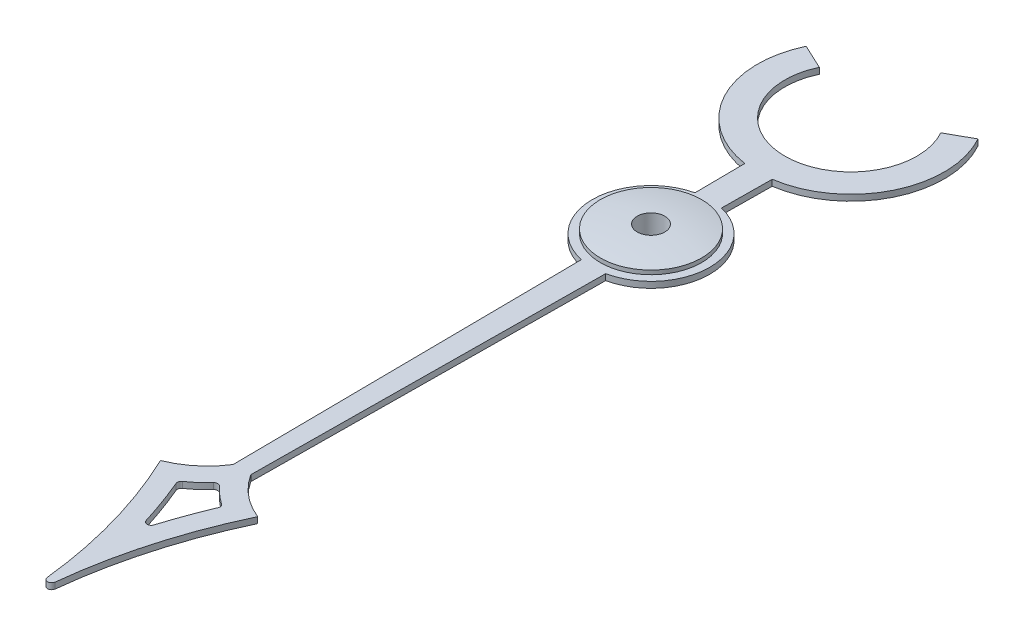
ISO-10303-21;
HEADER;
FILE_DESCRIPTION(('STEP AP214'),'2;1');
FILE_NAME('part.step','',(''),(''),'','','');
FILE_SCHEMA(('AUTOMOTIVE_DESIGN { 1 0 10303 214 1 1 1 1 }'));
ENDSEC;
DATA;
#1=APPLICATION_CONTEXT('core data for automotive mechanical design processes');
#2=APPLICATION_PROTOCOL_DEFINITION('international standard','automotive_design',2000,#1);
#3=PRODUCT_CONTEXT('',#1,'mechanical');
#4=PRODUCT('Part','Part','',(#3));
#5=PRODUCT_RELATED_PRODUCT_CATEGORY('part','',(#4));
#6=PRODUCT_DEFINITION_FORMATION('','',#4);
#7=PRODUCT_DEFINITION_CONTEXT('part definition',#1,'design');
#8=PRODUCT_DEFINITION('design','',#6,#7);
#9=PRODUCT_DEFINITION_SHAPE('','',#8);
#10=(LENGTH_UNIT() NAMED_UNIT(*) SI_UNIT(.MILLI.,.METRE.));
#11=(NAMED_UNIT(*) PLANE_ANGLE_UNIT() SI_UNIT($,.RADIAN.));
#12=(NAMED_UNIT(*) SI_UNIT($,.STERADIAN.) SOLID_ANGLE_UNIT());
#13=UNCERTAINTY_MEASURE_WITH_UNIT(LENGTH_MEASURE(1.E-05),#10,'distance_accuracy_value','');
#14=(GEOMETRIC_REPRESENTATION_CONTEXT(3) GLOBAL_UNCERTAINTY_ASSIGNED_CONTEXT((#13)) GLOBAL_UNIT_ASSIGNED_CONTEXT((#10,
#11,#12)) REPRESENTATION_CONTEXT('',''));
#15=CARTESIAN_POINT('',(0.,0.,0.));
#16=DIRECTION('',(0.,0.,1.));
#17=DIRECTION('',(1.,0.,0.));
#18=AXIS2_PLACEMENT_3D('',#15,#16,#17);
#19=CARTESIAN_POINT('',(12.1679754207257,0.15,16.115943661657));
#20=DIRECTION('',(0.,-1.,0.));
#21=DIRECTION('',(0.,0.,-1.));
#22=AXIS2_PLACEMENT_3D('',#19,#20,#21);
#23=PLANE('',#22);
#24=CARTESIAN_POINT('',(0.,0.15,0.));
#25=DIRECTION('',(0.,-1.,0.));
#26=DIRECTION('',(0.,0.,-1.));
#27=AXIS2_PLACEMENT_3D('',#24,#25,#26);
#28=CIRCLE('',#27,0.75);
#29=CARTESIAN_POINT('',(0.,0.15,-0.75));
#30=VERTEX_POINT('',#29);
#31=EDGE_CURVE('E271',#30,#30,#28,.T.);
#32=ORIENTED_EDGE('',*,*,#31,.F.);
#33=EDGE_LOOP('',(#32));
#34=FACE_BOUND('',#33,.T.);
#35=CARTESIAN_POINT('',(12.1679754207257,0.15,16.115943661657));
#36=DIRECTION('',(0.,1.,0.));
#37=DIRECTION('',(0.,0.,-1.));
#38=AXIS2_PLACEMENT_3D('',#35,#36,#37);
#39=CIRCLE('',#38,12.1392346232099);
#40=CARTESIAN_POINT('',(1.2,0.15,10.9135853110918));
#41=VERTEX_POINT('',#40);
#42=CARTESIAN_POINT('',(0.0982775993540998,0.15,14.8184800829326));
#43=VERTEX_POINT('',#42);
#44=EDGE_CURVE('E277',#41,#43,#39,.T.);
#45=ORIENTED_EDGE('',*,*,#44,.T.);
#46=CARTESIAN_POINT('',(0.,0.15,14.8));
#47=DIRECTION('',(0.,-1.,0.));
#48=DIRECTION('',(0.,0.,-1.));
#49=AXIS2_PLACEMENT_3D('',#46,#47,#48);
#50=CIRCLE('',#49,0.0999999999999994);
#51=CARTESIAN_POINT('',(-0.0982775993541001,0.15,14.8184800829326));
#52=VERTEX_POINT('',#51);
#53=EDGE_CURVE('E280',#43,#52,#50,.T.);
#54=ORIENTED_EDGE('',*,*,#53,.T.);
#55=CARTESIAN_POINT('',(-12.1679754207257,0.15,16.115943661657));
#56=DIRECTION('',(0.,1.,0.));
#57=DIRECTION('',(0.,0.,1.));
#58=AXIS2_PLACEMENT_3D('',#55,#56,#57);
#59=CIRCLE('',#58,12.1392346232099);
#60=CARTESIAN_POINT('',(-1.2,0.15,10.9135853110918));
#61=VERTEX_POINT('',#60);
#62=EDGE_CURVE('E283',#52,#61,#59,.T.);
#63=ORIENTED_EDGE('',*,*,#62,.T.);
#64=CARTESIAN_POINT('',(-1.97070913820673,0.15,8.98030368119698));
#65=DIRECTION('',(0.,1.,0.));
#66=DIRECTION('',(0.,0.,1.));
#67=AXIS2_PLACEMENT_3D('',#64,#65,#66);
#68=CIRCLE('',#67,2.08124252219777);
#69=CARTESIAN_POINT('',(-0.217926100813383,0.15,10.1024988781348));
#70=VERTEX_POINT('',#69);
#71=EDGE_CURVE('E285',#61,#70,#68,.T.);
#72=ORIENTED_EDGE('',*,*,#71,.T.);
#73=DIRECTION('',(-0.00945087932293805,0.,-0.999955339442729));
#74=VECTOR('',#73,1.);
#75=CARTESIAN_POINT('',(-0.217926100813383,0.15,10.1024988781348));
#76=LINE('',#75,#74);
#77=CARTESIAN_POINT('',(-0.3,0.15,1.41862609591111));
#78=VERTEX_POINT('',#77);
#79=EDGE_CURVE('E287',#70,#78,#76,.T.);
#80=ORIENTED_EDGE('',*,*,#79,.T.);
#81=CARTESIAN_POINT('',(0.,0.15,0.));
#82=DIRECTION('',(0.,-1.,0.));
#83=DIRECTION('',(0.,0.,-1.));
#84=AXIS2_PLACEMENT_3D('',#81,#82,#83);
#85=CIRCLE('',#84,1.45);
#86=CARTESIAN_POINT('',(-0.326759739049901,0.15,-1.41270240069735));
#87=VERTEX_POINT('',#86);
#88=EDGE_CURVE('E289',#78,#87,#85,.T.);
#89=ORIENTED_EDGE('',*,*,#88,.T.);
#90=DIRECTION('',(-0.00945087932293789,0.,-0.999955339442729));
#91=VECTOR('',#90,1.);
#92=CARTESIAN_POINT('',(-0.326759739049901,0.15,-1.41270240069735));
#93=LINE('',#92,#91);
#94=CARTESIAN_POINT('',(-0.338500561424638,0.15,-2.65494638899724));
#95=VERTEX_POINT('',#94);
#96=EDGE_CURVE('E291',#87,#95,#93,.T.);
#97=ORIENTED_EDGE('',*,*,#96,.T.);
#98=CARTESIAN_POINT('',(0.,0.15,-4.93742096375434));
#99=DIRECTION('',(0.,-1.,0.));
#100=DIRECTION('',(0.,0.,-1.));
#101=AXIS2_PLACEMENT_3D('',#98,#99,#100);
#102=CIRCLE('',#101,2.30743858303907);
#103=CARTESIAN_POINT('',(-2.08818750921553,0.15,-5.91912649030169));
#104=VERTEX_POINT('',#103);
#105=EDGE_CURVE('E293',#95,#104,#102,.T.);
#106=ORIENTED_EDGE('',*,*,#105,.T.);
#107=DIRECTION('',(0.905115867383996,0.,0.425164987516278));
#108=VECTOR('',#107,1.);
#109=CARTESIAN_POINT('',(-2.08818750921553,0.15,-5.91912649030169));
#110=LINE('',#109,#108);
#111=CARTESIAN_POINT('',(-1.4767232716382,0.15,-5.63190007619892));
#112=VERTEX_POINT('',#111);
#113=EDGE_CURVE('E295',#104,#112,#110,.T.);
#114=ORIENTED_EDGE('',*,*,#113,.T.);
#115=CARTESIAN_POINT('',(0.,0.15,-4.93742096375434));
#116=DIRECTION('',(0.,1.,0.));
#117=DIRECTION('',(0.,0.,-1.));
#118=AXIS2_PLACEMENT_3D('',#115,#116,#117);
#119=CIRCLE('',#118,1.63187403270585);
#120=CARTESIAN_POINT('',(1.4260211736018,0.15,-5.7308164962972));
#121=VERTEX_POINT('',#120);
#122=EDGE_CURVE('E297',#112,#121,#119,.T.);
#123=ORIENTED_EDGE('',*,*,#122,.T.);
#124=DIRECTION('',(0.874064876458558,0.,-0.485809213314738));
#125=VECTOR('',#124,1.);
#126=CARTESIAN_POINT('',(1.4260211736018,0.15,-5.7308164962972));
#127=LINE('',#126,#125);
#128=CARTESIAN_POINT('',(2.01650845779341,0.15,-6.05901200069473));
#129=VERTEX_POINT('',#128);
#130=EDGE_CURVE('E299',#121,#129,#127,.T.);
#131=ORIENTED_EDGE('',*,*,#130,.T.);
#132=CARTESIAN_POINT('',(0.,0.15,-4.93742096375434));
#133=DIRECTION('',(0.,-1.,0.));
#134=DIRECTION('',(0.,0.,-1.));
#135=AXIS2_PLACEMENT_3D('',#132,#133,#134);
#136=CIRCLE('',#135,2.30743858303907);
#137=CARTESIAN_POINT('',(0.338500561424638,0.15,-2.65494638899724));
#138=VERTEX_POINT('',#137);
#139=EDGE_CURVE('E301',#129,#138,#136,.T.);
#140=ORIENTED_EDGE('',*,*,#139,.T.);
#141=DIRECTION('',(-0.00945087932293784,0.,0.999955339442729));
#142=VECTOR('',#141,1.);
#143=CARTESIAN_POINT('',(0.326759739049901,0.15,-1.41270240069735));
#144=LINE('',#143,#142);
#145=CARTESIAN_POINT('',(0.326759739049901,0.15,-1.41270240069735));
#146=VERTEX_POINT('',#145);
#147=EDGE_CURVE('E303',#138,#146,#144,.T.);
#148=ORIENTED_EDGE('',*,*,#147,.T.);
#149=CARTESIAN_POINT('',(0.,0.15,0.));
#150=DIRECTION('',(0.,-1.,0.));
#151=DIRECTION('',(0.,0.,-1.));
#152=AXIS2_PLACEMENT_3D('',#149,#150,#151);
#153=CIRCLE('',#152,1.45);
#154=CARTESIAN_POINT('',(0.300000000000001,0.15,1.41862609591111));
#155=VERTEX_POINT('',#154);
#156=EDGE_CURVE('E305',#146,#155,#153,.T.);
#157=ORIENTED_EDGE('',*,*,#156,.T.);
#158=DIRECTION('',(-0.00945087932293803,0.,0.999955339442729));
#159=VECTOR('',#158,1.);
#160=CARTESIAN_POINT('',(0.217926100813383,0.15,10.1024988781348));
#161=LINE('',#160,#159);
#162=CARTESIAN_POINT('',(0.217926100813383,0.15,10.1024988781348));
#163=VERTEX_POINT('',#162);
#164=EDGE_CURVE('E307',#155,#163,#161,.T.);
#165=ORIENTED_EDGE('',*,*,#164,.T.);
#166=CARTESIAN_POINT('',(1.97070913820673,0.15,8.98030368119698));
#167=DIRECTION('',(0.,1.,0.));
#168=DIRECTION('',(0.,0.,-1.));
#169=AXIS2_PLACEMENT_3D('',#166,#167,#168);
#170=CIRCLE('',#169,2.08124252219777);
#171=EDGE_CURVE('E309',#163,#41,#170,.T.);
#172=ORIENTED_EDGE('',*,*,#171,.T.);
#173=EDGE_LOOP('',(#45,#54,#63,#72,#80,#89,#97,#106,#114,#123,#131,#140,#148,#157,#165,#172));
#174=FACE_BOUND('',#173,.T.);
#175=CARTESIAN_POINT('',(-12.1679754207257,0.15,16.115943661657));
#176=DIRECTION('',(0.,1.,0.));
#177=DIRECTION('',(0.,0.,1.));
#178=AXIS2_PLACEMENT_3D('',#175,#176,#177);
#179=CIRCLE('',#178,12.6392346232099);
#180=CARTESIAN_POINT('',(-0.0955157494199558,0.15,12.373488672583));
#181=VERTEX_POINT('',#180);
#182=CARTESIAN_POINT('',(-0.519143249821563,0.15,11.2113579590051));
#183=VERTEX_POINT('',#182);
#184=EDGE_CURVE('E214',#181,#183,#179,.T.);
#185=ORIENTED_EDGE('',*,*,#184,.F.);
#186=CARTESIAN_POINT('',(0.,0.15,12.3438788496733));
#187=DIRECTION('',(0.,-1.,0.));
#188=DIRECTION('',(0.,0.,-1.));
#189=AXIS2_PLACEMENT_3D('',#186,#187,#188);
#190=CIRCLE('',#189,0.0999999999999999);
#191=CARTESIAN_POINT('',(0.0955157494199575,0.15,12.373488672583));
#192=VERTEX_POINT('',#191);
#193=EDGE_CURVE('E206',#192,#181,#190,.T.);
#194=ORIENTED_EDGE('',*,*,#193,.F.);
#195=CARTESIAN_POINT('',(12.1679754207257,0.15,16.115943661657));
#196=DIRECTION('',(0.,1.,0.));
#197=DIRECTION('',(0.,0.,-1.));
#198=AXIS2_PLACEMENT_3D('',#195,#196,#197);
#199=CIRCLE('',#198,12.6392346232099);
#200=CARTESIAN_POINT('',(0.519143249821561,0.15,11.2113579590051));
#201=VERTEX_POINT('',#200);
#202=EDGE_CURVE('E239',#201,#192,#199,.T.);
#203=ORIENTED_EDGE('',*,*,#202,.F.);
#204=CARTESIAN_POINT('',(0.426979186742041,0.15,11.1725535072415));
#205=DIRECTION('',(0.,-1.,0.));
#206=DIRECTION('',(0.,0.,-1.));
#207=AXIS2_PLACEMENT_3D('',#204,#205,#206);
#208=CIRCLE('',#207,0.1);
#209=CARTESIAN_POINT('',(0.484554357159648,0.15,11.0907910479378));
#210=VERTEX_POINT('',#209);
#211=EDGE_CURVE('E237',#210,#201,#208,.T.);
#212=ORIENTED_EDGE('',*,*,#211,.F.);
#213=CARTESIAN_POINT('',(1.97070913820673,0.15,8.98030368119698));
#214=DIRECTION('',(0.,1.,0.));
#215=DIRECTION('',(0.,0.,-1.));
#216=AXIS2_PLACEMENT_3D('',#213,#214,#215);
#217=CIRCLE('',#216,2.58124252219777);
#218=CARTESIAN_POINT('',(0.0734998465036795,0.15,10.7305636224279));
#219=VERTEX_POINT('',#218);
#220=EDGE_CURVE('E235',#219,#210,#217,.T.);
#221=ORIENTED_EDGE('',*,*,#220,.F.);
#222=CARTESIAN_POINT('',(0.,0.15,10.7983704993943));
#223=DIRECTION('',(0.,-1.,0.));
#224=DIRECTION('',(0.,0.,1.));
#225=AXIS2_PLACEMENT_3D('',#222,#223,#224);
#226=CIRCLE('',#225,0.1);
#227=CARTESIAN_POINT('',(-0.0734998465036802,0.15,10.7305636224279));
#228=VERTEX_POINT('',#227);
#229=EDGE_CURVE('E233',#228,#219,#226,.T.);
#230=ORIENTED_EDGE('',*,*,#229,.F.);
#231=CARTESIAN_POINT('',(-1.97070913820673,0.15,8.98030368119698));
#232=DIRECTION('',(0.,1.,0.));
#233=DIRECTION('',(0.,0.,1.));
#234=AXIS2_PLACEMENT_3D('',#231,#232,#233);
#235=CIRCLE('',#234,2.58124252219777);
#236=CARTESIAN_POINT('',(-0.484554357159646,0.15,11.0907910479378));
#237=VERTEX_POINT('',#236);
#238=EDGE_CURVE('E229',#237,#228,#235,.T.);
#239=ORIENTED_EDGE('',*,*,#238,.F.);
#240=CARTESIAN_POINT('',(-0.42697918674204,0.15,11.1725535072415));
#241=DIRECTION('',(0.,-1.,0.));
#242=DIRECTION('',(0.,0.,-1.));
#243=AXIS2_PLACEMENT_3D('',#240,#241,#242);
#244=CIRCLE('',#243,0.1);
#245=EDGE_CURVE('E227',#183,#237,#244,.T.);
#246=ORIENTED_EDGE('',*,*,#245,.F.);
#247=EDGE_LOOP('',(#185,#194,#203,#212,#221,#230,#239,#246));
#248=FACE_BOUND('',#247,.T.);
#249=ADVANCED_FACE('F45',(#34,#174,#248),#23,.T.);
#250=CARTESIAN_POINT('',(12.1679754207257,0.3,16.115943661657));
#251=DIRECTION('',(0.,-1.,0.));
#252=DIRECTION('',(0.,0.,-1.));
#253=AXIS2_PLACEMENT_3D('',#250,#251,#252);
#254=PLANE('',#253);
#255=CARTESIAN_POINT('',(0.,0.3,0.));
#256=DIRECTION('',(0.,-1.,0.));
#257=DIRECTION('',(0.,0.,-1.));
#258=AXIS2_PLACEMENT_3D('',#255,#256,#257);
#259=CIRCLE('',#258,0.75);
#260=CARTESIAN_POINT('',(0.,0.3,-0.75));
#261=VERTEX_POINT('',#260);
#262=EDGE_CURVE('E222',#261,#261,#259,.T.);
#263=ORIENTED_EDGE('',*,*,#262,.T.);
#264=EDGE_LOOP('',(#263));
#265=FACE_BOUND('',#264,.T.);
#266=CARTESIAN_POINT('',(12.1679754207257,0.3,16.115943661657));
#267=DIRECTION('',(0.,1.,0.));
#268=DIRECTION('',(0.,0.,-1.));
#269=AXIS2_PLACEMENT_3D('',#266,#267,#268);
#270=CIRCLE('',#269,12.1392346232099);
#271=CARTESIAN_POINT('',(1.2,0.3,10.9135853110918));
#272=VERTEX_POINT('',#271);
#273=CARTESIAN_POINT('',(0.0982775993540998,0.3,14.8184800829326));
#274=VERTEX_POINT('',#273);
#275=EDGE_CURVE('E274',#272,#274,#270,.T.);
#276=ORIENTED_EDGE('',*,*,#275,.F.);
#277=CARTESIAN_POINT('',(1.97070913820673,0.3,8.98030368119698));
#278=DIRECTION('',(0.,1.,0.));
#279=DIRECTION('',(0.,0.,-1.));
#280=AXIS2_PLACEMENT_3D('',#277,#278,#279);
#281=CIRCLE('',#280,2.08124252219777);
#282=CARTESIAN_POINT('',(0.217926100813383,0.3,10.1024988781348));
#283=VERTEX_POINT('',#282);
#284=EDGE_CURVE('E281',#283,#272,#281,.T.);
#285=ORIENTED_EDGE('',*,*,#284,.F.);
#286=DIRECTION('',(-0.00945087932293803,0.,0.999955339442729));
#287=VECTOR('',#286,1.);
#288=CARTESIAN_POINT('',(0.217926100813383,0.3,10.1024988781348));
#289=LINE('',#288,#287);
#290=CARTESIAN_POINT('',(0.300000000000001,0.3,1.41862609591111));
#291=VERTEX_POINT('',#290);
#292=EDGE_CURVE('E340',#291,#283,#289,.T.);
#293=ORIENTED_EDGE('',*,*,#292,.F.);
#294=CARTESIAN_POINT('',(0.,0.3,0.));
#295=DIRECTION('',(0.,-1.,0.));
#296=DIRECTION('',(0.,0.,-1.));
#297=AXIS2_PLACEMENT_3D('',#294,#295,#296);
#298=CIRCLE('',#297,1.45);
#299=CARTESIAN_POINT('',(0.326759739049901,0.3,-1.41270240069735));
#300=VERTEX_POINT('',#299);
#301=EDGE_CURVE('E338',#300,#291,#298,.T.);
#302=ORIENTED_EDGE('',*,*,#301,.F.);
#303=DIRECTION('',(-0.00945087932293784,0.,0.999955339442729));
#304=VECTOR('',#303,1.);
#305=CARTESIAN_POINT('',(0.326759739049901,0.3,-1.41270240069735));
#306=LINE('',#305,#304);
#307=CARTESIAN_POINT('',(0.338500561424638,0.3,-2.65494638899724));
#308=VERTEX_POINT('',#307);
#309=EDGE_CURVE('E336',#308,#300,#306,.T.);
#310=ORIENTED_EDGE('',*,*,#309,.F.);
#311=CARTESIAN_POINT('',(0.,0.3,-4.93742096375434));
#312=DIRECTION('',(0.,-1.,0.));
#313=DIRECTION('',(0.,0.,-1.));
#314=AXIS2_PLACEMENT_3D('',#311,#312,#313);
#315=CIRCLE('',#314,2.30743858303907);
#316=CARTESIAN_POINT('',(2.01650845779341,0.3,-6.05901200069473));
#317=VERTEX_POINT('',#316);
#318=EDGE_CURVE('E334',#317,#308,#315,.T.);
#319=ORIENTED_EDGE('',*,*,#318,.F.);
#320=DIRECTION('',(0.874064876458558,0.,-0.485809213314738));
#321=VECTOR('',#320,1.);
#322=CARTESIAN_POINT('',(1.4260211736018,0.3,-5.7308164962972));
#323=LINE('',#322,#321);
#324=CARTESIAN_POINT('',(1.4260211736018,0.3,-5.7308164962972));
#325=VERTEX_POINT('',#324);
#326=EDGE_CURVE('E332',#325,#317,#323,.T.);
#327=ORIENTED_EDGE('',*,*,#326,.F.);
#328=CARTESIAN_POINT('',(0.,0.3,-4.93742096375434));
#329=DIRECTION('',(0.,1.,0.));
#330=DIRECTION('',(0.,0.,-1.));
#331=AXIS2_PLACEMENT_3D('',#328,#329,#330);
#332=CIRCLE('',#331,1.63187403270585);
#333=CARTESIAN_POINT('',(-1.4767232716382,0.3,-5.63190007619892));
#334=VERTEX_POINT('',#333);
#335=EDGE_CURVE('E330',#334,#325,#332,.T.);
#336=ORIENTED_EDGE('',*,*,#335,.F.);
#337=DIRECTION('',(0.905115867383996,0.,0.425164987516278));
#338=VECTOR('',#337,1.);
#339=CARTESIAN_POINT('',(-2.08818750921553,0.3,-5.91912649030169));
#340=LINE('',#339,#338);
#341=CARTESIAN_POINT('',(-2.08818750921553,0.3,-5.91912649030169));
#342=VERTEX_POINT('',#341);
#343=EDGE_CURVE('E328',#342,#334,#340,.T.);
#344=ORIENTED_EDGE('',*,*,#343,.F.);
#345=CARTESIAN_POINT('',(0.,0.3,-4.93742096375434));
#346=DIRECTION('',(0.,-1.,0.));
#347=DIRECTION('',(0.,0.,-1.));
#348=AXIS2_PLACEMENT_3D('',#345,#346,#347);
#349=CIRCLE('',#348,2.30743858303907);
#350=CARTESIAN_POINT('',(-0.338500561424638,0.3,-2.65494638899724));
#351=VERTEX_POINT('',#350);
#352=EDGE_CURVE('E326',#351,#342,#349,.T.);
#353=ORIENTED_EDGE('',*,*,#352,.F.);
#354=DIRECTION('',(-0.00945087932293789,0.,-0.999955339442729));
#355=VECTOR('',#354,1.);
#356=CARTESIAN_POINT('',(-0.326759739049901,0.3,-1.41270240069735));
#357=LINE('',#356,#355);
#358=CARTESIAN_POINT('',(-0.326759739049901,0.3,-1.41270240069735));
#359=VERTEX_POINT('',#358);
#360=EDGE_CURVE('E324',#359,#351,#357,.T.);
#361=ORIENTED_EDGE('',*,*,#360,.F.);
#362=CARTESIAN_POINT('',(0.,0.3,0.));
#363=DIRECTION('',(0.,-1.,0.));
#364=DIRECTION('',(0.,0.,-1.));
#365=AXIS2_PLACEMENT_3D('',#362,#363,#364);
#366=CIRCLE('',#365,1.45);
#367=CARTESIAN_POINT('',(-0.3,0.3,1.41862609591111));
#368=VERTEX_POINT('',#367);
#369=EDGE_CURVE('E322',#368,#359,#366,.T.);
#370=ORIENTED_EDGE('',*,*,#369,.F.);
#371=DIRECTION('',(-0.00945087932293805,0.,-0.999955339442729));
#372=VECTOR('',#371,1.);
#373=CARTESIAN_POINT('',(-0.217926100813383,0.3,10.1024988781348));
#374=LINE('',#373,#372);
#375=CARTESIAN_POINT('',(-0.217926100813383,0.3,10.1024988781348));
#376=VERTEX_POINT('',#375);
#377=EDGE_CURVE('E320',#376,#368,#374,.T.);
#378=ORIENTED_EDGE('',*,*,#377,.F.);
#379=CARTESIAN_POINT('',(-1.97070913820673,0.3,8.98030368119698));
#380=DIRECTION('',(0.,1.,0.));
#381=DIRECTION('',(0.,0.,1.));
#382=AXIS2_PLACEMENT_3D('',#379,#380,#381);
#383=CIRCLE('',#382,2.08124252219777);
#384=CARTESIAN_POINT('',(-1.2,0.3,10.9135853110918));
#385=VERTEX_POINT('',#384);
#386=EDGE_CURVE('E318',#385,#376,#383,.T.);
#387=ORIENTED_EDGE('',*,*,#386,.F.);
#388=CARTESIAN_POINT('',(-12.1679754207257,0.3,16.115943661657));
#389=DIRECTION('',(0.,1.,0.));
#390=DIRECTION('',(0.,0.,1.));
#391=AXIS2_PLACEMENT_3D('',#388,#389,#390);
#392=CIRCLE('',#391,12.1392346232099);
#393=CARTESIAN_POINT('',(-0.0982775993541001,0.3,14.8184800829326));
#394=VERTEX_POINT('',#393);
#395=EDGE_CURVE('E316',#394,#385,#392,.T.);
#396=ORIENTED_EDGE('',*,*,#395,.F.);
#397=CARTESIAN_POINT('',(0.,0.3,14.8));
#398=DIRECTION('',(0.,-1.,0.));
#399=DIRECTION('',(0.,0.,-1.));
#400=AXIS2_PLACEMENT_3D('',#397,#398,#399);
#401=CIRCLE('',#400,0.0999999999999994);
#402=EDGE_CURVE('E314',#274,#394,#401,.T.);
#403=ORIENTED_EDGE('',*,*,#402,.F.);
#404=EDGE_LOOP('',(#276,#285,#293,#302,#310,#319,#327,#336,#344,#353,#361,#370,#378,#387,#396,#403));
#405=FACE_BOUND('',#404,.T.);
#406=CARTESIAN_POINT('',(0.,0.3,12.3438788496733));
#407=DIRECTION('',(0.,-1.,0.));
#408=DIRECTION('',(0.,0.,-1.));
#409=AXIS2_PLACEMENT_3D('',#406,#407,#408);
#410=CIRCLE('',#409,0.0999999999999999);
#411=CARTESIAN_POINT('',(0.0955157494199575,0.3,12.373488672583));
#412=VERTEX_POINT('',#411);
#413=CARTESIAN_POINT('',(-0.0955157494199558,0.3,12.373488672583));
#414=VERTEX_POINT('',#413);
#415=EDGE_CURVE('E68',#412,#414,#410,.T.);
#416=ORIENTED_EDGE('',*,*,#415,.T.);
#417=CARTESIAN_POINT('',(-12.1679754207257,0.3,16.115943661657));
#418=DIRECTION('',(0.,1.,0.));
#419=DIRECTION('',(0.,0.,1.));
#420=AXIS2_PLACEMENT_3D('',#417,#418,#419);
#421=CIRCLE('',#420,12.6392346232099);
#422=CARTESIAN_POINT('',(-0.519143249821563,0.3,11.2113579590051));
#423=VERTEX_POINT('',#422);
#424=EDGE_CURVE('E221',#414,#423,#421,.T.);
#425=ORIENTED_EDGE('',*,*,#424,.T.);
#426=CARTESIAN_POINT('',(-0.42697918674204,0.3,11.1725535072415));
#427=DIRECTION('',(0.,-1.,0.));
#428=DIRECTION('',(0.,0.,-1.));
#429=AXIS2_PLACEMENT_3D('',#426,#427,#428);
#430=CIRCLE('',#429,0.1);
#431=CARTESIAN_POINT('',(-0.484554357159646,0.3,11.0907910479378));
#432=VERTEX_POINT('',#431);
#433=EDGE_CURVE('E243',#423,#432,#430,.T.);
#434=ORIENTED_EDGE('',*,*,#433,.T.);
#435=CARTESIAN_POINT('',(-1.97070913820673,0.3,8.98030368119698));
#436=DIRECTION('',(0.,1.,0.));
#437=DIRECTION('',(0.,0.,1.));
#438=AXIS2_PLACEMENT_3D('',#435,#436,#437);
#439=CIRCLE('',#438,2.58124252219777);
#440=CARTESIAN_POINT('',(-0.0734998465036802,0.3,10.7305636224279));
#441=VERTEX_POINT('',#440);
#442=EDGE_CURVE('E246',#432,#441,#439,.T.);
#443=ORIENTED_EDGE('',*,*,#442,.T.);
#444=CARTESIAN_POINT('',(0.,0.3,10.7983704993943));
#445=DIRECTION('',(0.,-1.,0.));
#446=DIRECTION('',(0.,0.,1.));
#447=AXIS2_PLACEMENT_3D('',#444,#445,#446);
#448=CIRCLE('',#447,0.1);
#449=CARTESIAN_POINT('',(0.0734998465036795,0.3,10.7305636224279));
#450=VERTEX_POINT('',#449);
#451=EDGE_CURVE('E249',#441,#450,#448,.T.);
#452=ORIENTED_EDGE('',*,*,#451,.T.);
#453=CARTESIAN_POINT('',(1.97070913820673,0.3,8.98030368119698));
#454=DIRECTION('',(0.,1.,0.));
#455=DIRECTION('',(0.,0.,-1.));
#456=AXIS2_PLACEMENT_3D('',#453,#454,#455);
#457=CIRCLE('',#456,2.58124252219777);
#458=CARTESIAN_POINT('',(0.484554357159648,0.3,11.0907910479378));
#459=VERTEX_POINT('',#458);
#460=EDGE_CURVE('E252',#450,#459,#457,.T.);
#461=ORIENTED_EDGE('',*,*,#460,.T.);
#462=CARTESIAN_POINT('',(0.426979186742041,0.3,11.1725535072415));
#463=DIRECTION('',(0.,-1.,0.));
#464=DIRECTION('',(0.,0.,-1.));
#465=AXIS2_PLACEMENT_3D('',#462,#463,#464);
#466=CIRCLE('',#465,0.1);
#467=CARTESIAN_POINT('',(0.519143249821561,0.3,11.2113579590051));
#468=VERTEX_POINT('',#467);
#469=EDGE_CURVE('E255',#459,#468,#466,.T.);
#470=ORIENTED_EDGE('',*,*,#469,.T.);
#471=CARTESIAN_POINT('',(12.1679754207257,0.3,16.115943661657));
#472=DIRECTION('',(0.,1.,0.));
#473=DIRECTION('',(0.,0.,-1.));
#474=AXIS2_PLACEMENT_3D('',#471,#472,#473);
#475=CIRCLE('',#474,12.6392346232099);
#476=EDGE_CURVE('E215',#468,#412,#475,.T.);
#477=ORIENTED_EDGE('',*,*,#476,.T.);
#478=EDGE_LOOP('',(#416,#425,#434,#443,#452,#461,#470,#477));
#479=FACE_BOUND('',#478,.T.);
#480=ADVANCED_FACE('F394',(#265,#405,#479),#254,.F.);
#481=CARTESIAN_POINT('',(12.1679754207257,0.15,16.115943661657));
#482=DIRECTION('',(0.,1.,0.));
#483=DIRECTION('',(0.,0.,1.));
#484=AXIS2_PLACEMENT_3D('',#481,#482,#483);
#485=CYLINDRICAL_SURFACE('',#484,12.1392346232099);
#486=ORIENTED_EDGE('',*,*,#275,.T.);
#487=DIRECTION('',(0.,1.,0.));
#488=VECTOR('',#487,1.);
#489=CARTESIAN_POINT('',(0.0982775993540998,0.15,14.8184800829326));
#490=LINE('',#489,#488);
#491=EDGE_CURVE('E12',#43,#274,#490,.T.);
#492=ORIENTED_EDGE('',*,*,#491,.F.);
#493=ORIENTED_EDGE('',*,*,#44,.F.);
#494=DIRECTION('',(0.,1.,0.));
#495=VECTOR('',#494,1.);
#496=CARTESIAN_POINT('',(1.2,0.15,10.9135853110918));
#497=LINE('',#496,#495);
#498=EDGE_CURVE('E311',#41,#272,#497,.T.);
#499=ORIENTED_EDGE('',*,*,#498,.T.);
#500=EDGE_LOOP('',(#486,#492,#493,#499));
#501=FACE_BOUND('',#500,.T.);
#502=ADVANCED_FACE('F47',(#501),#485,.F.);
#503=CARTESIAN_POINT('',(0.,0.15,14.8));
#504=DIRECTION('',(0.,1.,0.));
#505=DIRECTION('',(0.,0.,1.));
#506=AXIS2_PLACEMENT_3D('',#503,#504,#505);
#507=CYLINDRICAL_SURFACE('',#506,0.0999999999999994);
#508=ORIENTED_EDGE('',*,*,#402,.T.);
#509=DIRECTION('',(0.,1.,0.));
#510=VECTOR('',#509,1.);
#511=CARTESIAN_POINT('',(-0.0982775993541001,0.15,14.8184800829326));
#512=LINE('',#511,#510);
#513=EDGE_CURVE('E53',#52,#394,#512,.T.);
#514=ORIENTED_EDGE('',*,*,#513,.F.);
#515=ORIENTED_EDGE('',*,*,#53,.F.);
#516=ORIENTED_EDGE('',*,*,#491,.T.);
#517=EDGE_LOOP('',(#508,#514,#515,#516));
#518=FACE_BOUND('',#517,.T.);
#519=ADVANCED_FACE('F411',(#518),#507,.T.);
#520=CARTESIAN_POINT('',(-12.1679754207257,0.15,16.115943661657));
#521=DIRECTION('',(0.,1.,0.));
#522=DIRECTION('',(0.,0.,1.));
#523=AXIS2_PLACEMENT_3D('',#520,#521,#522);
#524=CYLINDRICAL_SURFACE('',#523,12.1392346232099);
#525=ORIENTED_EDGE('',*,*,#395,.T.);
#526=DIRECTION('',(0.,1.,0.));
#527=VECTOR('',#526,1.);
#528=CARTESIAN_POINT('',(-1.2,0.15,10.9135853110918));
#529=LINE('',#528,#527);
#530=EDGE_CURVE('E381',#61,#385,#529,.T.);
#531=ORIENTED_EDGE('',*,*,#530,.F.);
#532=ORIENTED_EDGE('',*,*,#62,.F.);
#533=ORIENTED_EDGE('',*,*,#513,.T.);
#534=EDGE_LOOP('',(#525,#531,#532,#533));
#535=FACE_BOUND('',#534,.T.);
#536=ADVANCED_FACE('F388',(#535),#524,.F.);
#537=CARTESIAN_POINT('',(-1.97070913820673,0.15,8.98030368119698));
#538=DIRECTION('',(0.,1.,0.));
#539=DIRECTION('',(0.,0.,1.));
#540=AXIS2_PLACEMENT_3D('',#537,#538,#539);
#541=CYLINDRICAL_SURFACE('',#540,2.08124252219777);
#542=ORIENTED_EDGE('',*,*,#386,.T.);
#543=DIRECTION('',(0.,1.,0.));
#544=VECTOR('',#543,1.);
#545=CARTESIAN_POINT('',(-0.217926100813383,0.15,10.1024988781348));
#546=LINE('',#545,#544);
#547=EDGE_CURVE('E378',#70,#376,#546,.T.);
#548=ORIENTED_EDGE('',*,*,#547,.F.);
#549=ORIENTED_EDGE('',*,*,#71,.F.);
#550=ORIENTED_EDGE('',*,*,#530,.T.);
#551=EDGE_LOOP('',(#542,#548,#549,#550));
#552=FACE_BOUND('',#551,.T.);
#553=ADVANCED_FACE('F400',(#552),#541,.F.);
#554=CARTESIAN_POINT('',(-0.217926100813383,0.15,10.1024988781348));
#555=DIRECTION('',(0.999955339442729,0.,-0.00945087932293805));
#556=DIRECTION('',(-0.00945087932293805,0.,-0.999955339442729));
#557=AXIS2_PLACEMENT_3D('',#554,#555,#556);
#558=PLANE('',#557);
#559=ORIENTED_EDGE('',*,*,#377,.T.);
#560=DIRECTION('',(0.,1.,0.));
#561=VECTOR('',#560,1.);
#562=CARTESIAN_POINT('',(-0.3,0.15,1.41862609591111));
#563=LINE('',#562,#561);
#564=EDGE_CURVE('E375',#78,#368,#563,.T.);
#565=ORIENTED_EDGE('',*,*,#564,.F.);
#566=ORIENTED_EDGE('',*,*,#79,.F.);
#567=ORIENTED_EDGE('',*,*,#547,.T.);
#568=EDGE_LOOP('',(#559,#565,#566,#567));
#569=FACE_BOUND('',#568,.T.);
#570=ADVANCED_FACE('F404',(#569),#558,.F.);
#571=CARTESIAN_POINT('',(0.,0.15,0.));
#572=DIRECTION('',(0.,1.,0.));
#573=DIRECTION('',(0.,0.,1.));
#574=AXIS2_PLACEMENT_3D('',#571,#572,#573);
#575=CYLINDRICAL_SURFACE('',#574,1.45);
#576=ORIENTED_EDGE('',*,*,#369,.T.);
#577=DIRECTION('',(0.,1.,0.));
#578=VECTOR('',#577,1.);
#579=CARTESIAN_POINT('',(-0.326759739049901,0.15,-1.41270240069735));
#580=LINE('',#579,#578);
#581=EDGE_CURVE('E372',#87,#359,#580,.T.);
#582=ORIENTED_EDGE('',*,*,#581,.F.);
#583=ORIENTED_EDGE('',*,*,#88,.F.);
#584=ORIENTED_EDGE('',*,*,#564,.T.);
#585=EDGE_LOOP('',(#576,#582,#583,#584));
#586=FACE_BOUND('',#585,.T.);
#587=ADVANCED_FACE('F464',(#586),#575,.T.);
#588=CARTESIAN_POINT('',(-0.326759739049901,0.15,-1.41270240069735));
#589=DIRECTION('',(0.999955339442729,0.,-0.00945087932293789));
#590=DIRECTION('',(-0.00945087932293789,0.,-0.999955339442729));
#591=AXIS2_PLACEMENT_3D('',#588,#589,#590);
#592=PLANE('',#591);
#593=ORIENTED_EDGE('',*,*,#360,.T.);
#594=DIRECTION('',(0.,1.,0.));
#595=VECTOR('',#594,1.);
#596=CARTESIAN_POINT('',(-0.338500561424638,0.15,-2.65494638899724));
#597=LINE('',#596,#595);
#598=EDGE_CURVE('E369',#95,#351,#597,.T.);
#599=ORIENTED_EDGE('',*,*,#598,.F.);
#600=ORIENTED_EDGE('',*,*,#96,.F.);
#601=ORIENTED_EDGE('',*,*,#581,.T.);
#602=EDGE_LOOP('',(#593,#599,#600,#601));
#603=FACE_BOUND('',#602,.T.);
#604=ADVANCED_FACE('F461',(#603),#592,.F.);
#605=CARTESIAN_POINT('',(0.,0.15,-4.93742096375434));
#606=DIRECTION('',(0.,1.,0.));
#607=DIRECTION('',(0.,0.,1.));
#608=AXIS2_PLACEMENT_3D('',#605,#606,#607);
#609=CYLINDRICAL_SURFACE('',#608,2.30743858303907);
#610=ORIENTED_EDGE('',*,*,#352,.T.);
#611=DIRECTION('',(0.,1.,0.));
#612=VECTOR('',#611,1.);
#613=CARTESIAN_POINT('',(-2.08818750921553,0.15,-5.91912649030169));
#614=LINE('',#613,#612);
#615=EDGE_CURVE('E366',#104,#342,#614,.T.);
#616=ORIENTED_EDGE('',*,*,#615,.F.);
#617=ORIENTED_EDGE('',*,*,#105,.F.);
#618=ORIENTED_EDGE('',*,*,#598,.T.);
#619=EDGE_LOOP('',(#610,#616,#617,#618));
#620=FACE_BOUND('',#619,.T.);
#621=ADVANCED_FACE('F457',(#620),#609,.T.);
#622=CARTESIAN_POINT('',(-2.08818750921553,0.15,-5.91912649030169));
#623=DIRECTION('',(-0.425164987516278,0.,0.905115867383996));
#624=DIRECTION('',(0.905115867383996,0.,0.425164987516278));
#625=AXIS2_PLACEMENT_3D('',#622,#623,#624);
#626=PLANE('',#625);
#627=ORIENTED_EDGE('',*,*,#343,.T.);
#628=DIRECTION('',(0.,1.,0.));
#629=VECTOR('',#628,1.);
#630=CARTESIAN_POINT('',(-1.4767232716382,0.15,-5.63190007619892));
#631=LINE('',#630,#629);
#632=EDGE_CURVE('E363',#112,#334,#631,.T.);
#633=ORIENTED_EDGE('',*,*,#632,.F.);
#634=ORIENTED_EDGE('',*,*,#113,.F.);
#635=ORIENTED_EDGE('',*,*,#615,.T.);
#636=EDGE_LOOP('',(#627,#633,#634,#635));
#637=FACE_BOUND('',#636,.T.);
#638=ADVANCED_FACE('F453',(#637),#626,.F.);
#639=CARTESIAN_POINT('',(0.,0.15,-4.93742096375434));
#640=DIRECTION('',(0.,1.,0.));
#641=DIRECTION('',(0.,0.,1.));
#642=AXIS2_PLACEMENT_3D('',#639,#640,#641);
#643=CYLINDRICAL_SURFACE('',#642,1.63187403270585);
#644=ORIENTED_EDGE('',*,*,#335,.T.);
#645=DIRECTION('',(0.,1.,0.));
#646=VECTOR('',#645,1.);
#647=CARTESIAN_POINT('',(1.4260211736018,0.15,-5.7308164962972));
#648=LINE('',#647,#646);
#649=EDGE_CURVE('E360',#121,#325,#648,.T.);
#650=ORIENTED_EDGE('',*,*,#649,.F.);
#651=ORIENTED_EDGE('',*,*,#122,.F.);
#652=ORIENTED_EDGE('',*,*,#632,.T.);
#653=EDGE_LOOP('',(#644,#650,#651,#652));
#654=FACE_BOUND('',#653,.T.);
#655=ADVANCED_FACE('F448',(#654),#643,.F.);
#656=CARTESIAN_POINT('',(1.4260211736018,0.15,-5.7308164962972));
#657=DIRECTION('',(0.485809213314738,0.,0.874064876458558));
#658=DIRECTION('',(0.874064876458558,0.,-0.485809213314738));
#659=AXIS2_PLACEMENT_3D('',#656,#657,#658);
#660=PLANE('',#659);
#661=ORIENTED_EDGE('',*,*,#326,.T.);
#662=DIRECTION('',(0.,1.,0.));
#663=VECTOR('',#662,1.);
#664=CARTESIAN_POINT('',(2.01650845779341,0.15,-6.05901200069473));
#665=LINE('',#664,#663);
#666=EDGE_CURVE('E357',#129,#317,#665,.T.);
#667=ORIENTED_EDGE('',*,*,#666,.F.);
#668=ORIENTED_EDGE('',*,*,#130,.F.);
#669=ORIENTED_EDGE('',*,*,#649,.T.);
#670=EDGE_LOOP('',(#661,#667,#668,#669));
#671=FACE_BOUND('',#670,.T.);
#672=ADVANCED_FACE('F442',(#671),#660,.F.);
#673=CARTESIAN_POINT('',(0.,0.15,-4.93742096375434));
#674=DIRECTION('',(0.,1.,0.));
#675=DIRECTION('',(0.,0.,1.));
#676=AXIS2_PLACEMENT_3D('',#673,#674,#675);
#677=CYLINDRICAL_SURFACE('',#676,2.30743858303907);
#678=ORIENTED_EDGE('',*,*,#318,.T.);
#679=DIRECTION('',(0.,1.,0.));
#680=VECTOR('',#679,1.);
#681=CARTESIAN_POINT('',(0.338500561424638,0.15,-2.65494638899724));
#682=LINE('',#681,#680);
#683=EDGE_CURVE('E354',#138,#308,#682,.T.);
#684=ORIENTED_EDGE('',*,*,#683,.F.);
#685=ORIENTED_EDGE('',*,*,#139,.F.);
#686=ORIENTED_EDGE('',*,*,#666,.T.);
#687=EDGE_LOOP('',(#678,#684,#685,#686));
#688=FACE_BOUND('',#687,.T.);
#689=ADVANCED_FACE('F438',(#688),#677,.T.);
#690=CARTESIAN_POINT('',(0.326759739049901,0.15,-1.41270240069735));
#691=DIRECTION('',(-0.999955339442729,0.,-0.00945087932293784));
#692=DIRECTION('',(-0.00945087932293784,0.,0.999955339442729));
#693=AXIS2_PLACEMENT_3D('',#690,#691,#692);
#694=PLANE('',#693);
#695=ORIENTED_EDGE('',*,*,#309,.T.);
#696=DIRECTION('',(0.,1.,0.));
#697=VECTOR('',#696,1.);
#698=CARTESIAN_POINT('',(0.326759739049901,0.15,-1.41270240069735));
#699=LINE('',#698,#697);
#700=EDGE_CURVE('E351',#146,#300,#699,.T.);
#701=ORIENTED_EDGE('',*,*,#700,.F.);
#702=ORIENTED_EDGE('',*,*,#147,.F.);
#703=ORIENTED_EDGE('',*,*,#683,.T.);
#704=EDGE_LOOP('',(#695,#701,#702,#703));
#705=FACE_BOUND('',#704,.T.);
#706=ADVANCED_FACE('F433',(#705),#694,.F.);
#707=CARTESIAN_POINT('',(0.,0.15,0.));
#708=DIRECTION('',(0.,1.,0.));
#709=DIRECTION('',(0.,0.,1.));
#710=AXIS2_PLACEMENT_3D('',#707,#708,#709);
#711=CYLINDRICAL_SURFACE('',#710,1.45);
#712=ORIENTED_EDGE('',*,*,#301,.T.);
#713=DIRECTION('',(0.,1.,0.));
#714=VECTOR('',#713,1.);
#715=CARTESIAN_POINT('',(0.300000000000001,0.15,1.41862609591111));
#716=LINE('',#715,#714);
#717=EDGE_CURVE('E348',#155,#291,#716,.T.);
#718=ORIENTED_EDGE('',*,*,#717,.F.);
#719=ORIENTED_EDGE('',*,*,#156,.F.);
#720=ORIENTED_EDGE('',*,*,#700,.T.);
#721=EDGE_LOOP('',(#712,#718,#719,#720));
#722=FACE_BOUND('',#721,.T.);
#723=ADVANCED_FACE('F427',(#722),#711,.T.);
#724=CARTESIAN_POINT('',(0.217926100813383,0.15,10.1024988781348));
#725=DIRECTION('',(-0.999955339442729,0.,-0.00945087932293803));
#726=DIRECTION('',(-0.00945087932293803,0.,0.999955339442729));
#727=AXIS2_PLACEMENT_3D('',#724,#725,#726);
#728=PLANE('',#727);
#729=ORIENTED_EDGE('',*,*,#292,.T.);
#730=DIRECTION('',(0.,1.,0.));
#731=VECTOR('',#730,1.);
#732=CARTESIAN_POINT('',(0.217926100813383,0.15,10.1024988781348));
#733=LINE('',#732,#731);
#734=EDGE_CURVE('E345',#163,#283,#733,.T.);
#735=ORIENTED_EDGE('',*,*,#734,.F.);
#736=ORIENTED_EDGE('',*,*,#164,.F.);
#737=ORIENTED_EDGE('',*,*,#717,.T.);
#738=EDGE_LOOP('',(#729,#735,#736,#737));
#739=FACE_BOUND('',#738,.T.);
#740=ADVANCED_FACE('F423',(#739),#728,.F.);
#741=CARTESIAN_POINT('',(1.97070913820673,0.15,8.98030368119698));
#742=DIRECTION('',(0.,1.,0.));
#743=DIRECTION('',(0.,0.,1.));
#744=AXIS2_PLACEMENT_3D('',#741,#742,#743);
#745=CYLINDRICAL_SURFACE('',#744,2.08124252219777);
#746=ORIENTED_EDGE('',*,*,#284,.T.);
#747=ORIENTED_EDGE('',*,*,#498,.F.);
#748=ORIENTED_EDGE('',*,*,#171,.F.);
#749=ORIENTED_EDGE('',*,*,#734,.T.);
#750=EDGE_LOOP('',(#746,#747,#748,#749));
#751=FACE_BOUND('',#750,.T.);
#752=ADVANCED_FACE('F418',(#751),#745,.F.);
#753=CARTESIAN_POINT('',(0.,0.15,0.));
#754=DIRECTION('',(0.,1.,0.));
#755=DIRECTION('',(0.,0.,1.));
#756=AXIS2_PLACEMENT_3D('',#753,#754,#755);
#757=CYLINDRICAL_SURFACE('',#756,0.75);
#758=ORIENTED_EDGE('',*,*,#31,.T.);
#759=EDGE_LOOP('',(#758));
#760=FACE_BOUND('',#759,.T.);
#761=ORIENTED_EDGE('',*,*,#262,.F.);
#762=EDGE_LOOP('',(#761));
#763=FACE_BOUND('',#762,.T.);
#764=ADVANCED_FACE('F483',(#760,#763),#757,.F.);
#765=CARTESIAN_POINT('',(0.,0.15,12.3438788496733));
#766=DIRECTION('',(0.,1.,0.));
#767=DIRECTION('',(0.,0.,1.));
#768=AXIS2_PLACEMENT_3D('',#765,#766,#767);
#769=CYLINDRICAL_SURFACE('',#768,0.0999999999999999);
#770=ORIENTED_EDGE('',*,*,#415,.F.);
#771=DIRECTION('',(0.,1.,0.));
#772=VECTOR('',#771,1.);
#773=CARTESIAN_POINT('',(0.0955157494199575,0.15,12.373488672583));
#774=LINE('',#773,#772);
#775=EDGE_CURVE('E210',#192,#412,#774,.T.);
#776=ORIENTED_EDGE('',*,*,#775,.F.);
#777=ORIENTED_EDGE('',*,*,#193,.T.);
#778=DIRECTION('',(0.,1.,0.));
#779=VECTOR('',#778,1.);
#780=CARTESIAN_POINT('',(-0.0955157494199558,0.15,12.373488672583));
#781=LINE('',#780,#779);
#782=EDGE_CURVE('E209',#181,#414,#781,.T.);
#783=ORIENTED_EDGE('',*,*,#782,.T.);
#784=EDGE_LOOP('',(#770,#776,#777,#783));
#785=FACE_BOUND('',#784,.T.);
#786=ADVANCED_FACE('F208',(#785),#769,.F.);
#787=CARTESIAN_POINT('',(-12.1679754207257,0.15,16.115943661657));
#788=DIRECTION('',(0.,1.,0.));
#789=DIRECTION('',(0.,0.,1.));
#790=AXIS2_PLACEMENT_3D('',#787,#788,#789);
#791=CYLINDRICAL_SURFACE('',#790,12.6392346232099);
#792=ORIENTED_EDGE('',*,*,#424,.F.);
#793=ORIENTED_EDGE('',*,*,#782,.F.);
#794=ORIENTED_EDGE('',*,*,#184,.T.);
#795=DIRECTION('',(0.,1.,0.));
#796=VECTOR('',#795,1.);
#797=CARTESIAN_POINT('',(-0.519143249821563,0.15,11.2113579590051));
#798=LINE('',#797,#796);
#799=EDGE_CURVE('E223',#183,#423,#798,.T.);
#800=ORIENTED_EDGE('',*,*,#799,.T.);
#801=EDGE_LOOP('',(#792,#793,#794,#800));
#802=FACE_BOUND('',#801,.T.);
#803=ADVANCED_FACE('F218',(#802),#791,.T.);
#804=CARTESIAN_POINT('',(-0.42697918674204,0.15,11.1725535072415));
#805=DIRECTION('',(0.,1.,0.));
#806=DIRECTION('',(0.,0.,1.));
#807=AXIS2_PLACEMENT_3D('',#804,#805,#806);
#808=CYLINDRICAL_SURFACE('',#807,0.1);
#809=ORIENTED_EDGE('',*,*,#433,.F.);
#810=ORIENTED_EDGE('',*,*,#799,.F.);
#811=ORIENTED_EDGE('',*,*,#245,.T.);
#812=DIRECTION('',(0.,1.,0.));
#813=VECTOR('',#812,1.);
#814=CARTESIAN_POINT('',(-0.484554357159646,0.15,11.0907910479378));
#815=LINE('',#814,#813);
#816=EDGE_CURVE('E268',#237,#432,#815,.T.);
#817=ORIENTED_EDGE('',*,*,#816,.T.);
#818=EDGE_LOOP('',(#809,#810,#811,#817));
#819=FACE_BOUND('',#818,.T.);
#820=ADVANCED_FACE('F556',(#819),#808,.F.);
#821=CARTESIAN_POINT('',(-1.97070913820673,0.15,8.98030368119698));
#822=DIRECTION('',(0.,1.,0.));
#823=DIRECTION('',(0.,0.,1.));
#824=AXIS2_PLACEMENT_3D('',#821,#822,#823);
#825=CYLINDRICAL_SURFACE('',#824,2.58124252219777);
#826=ORIENTED_EDGE('',*,*,#442,.F.);
#827=ORIENTED_EDGE('',*,*,#816,.F.);
#828=ORIENTED_EDGE('',*,*,#238,.T.);
#829=DIRECTION('',(0.,1.,0.));
#830=VECTOR('',#829,1.);
#831=CARTESIAN_POINT('',(-0.0734998465036802,0.15,10.7305636224279));
#832=LINE('',#831,#830);
#833=EDGE_CURVE('E266',#228,#441,#832,.T.);
#834=ORIENTED_EDGE('',*,*,#833,.T.);
#835=EDGE_LOOP('',(#826,#827,#828,#834));
#836=FACE_BOUND('',#835,.T.);
#837=ADVANCED_FACE('F563',(#836),#825,.T.);
#838=CARTESIAN_POINT('',(0.,0.15,10.7983704993943));
#839=DIRECTION('',(0.,1.,0.));
#840=DIRECTION('',(0.,0.,1.));
#841=AXIS2_PLACEMENT_3D('',#838,#839,#840);
#842=CYLINDRICAL_SURFACE('',#841,0.1);
#843=ORIENTED_EDGE('',*,*,#451,.F.);
#844=ORIENTED_EDGE('',*,*,#833,.F.);
#845=ORIENTED_EDGE('',*,*,#229,.T.);
#846=DIRECTION('',(0.,1.,0.));
#847=VECTOR('',#846,1.);
#848=CARTESIAN_POINT('',(0.0734998465036795,0.15,10.7305636224279));
#849=LINE('',#848,#847);
#850=EDGE_CURVE('E264',#219,#450,#849,.T.);
#851=ORIENTED_EDGE('',*,*,#850,.T.);
#852=EDGE_LOOP('',(#843,#844,#845,#851));
#853=FACE_BOUND('',#852,.T.);
#854=ADVANCED_FACE('F571',(#853),#842,.F.);
#855=CARTESIAN_POINT('',(1.97070913820673,0.15,8.98030368119698));
#856=DIRECTION('',(0.,1.,0.));
#857=DIRECTION('',(0.,0.,1.));
#858=AXIS2_PLACEMENT_3D('',#855,#856,#857);
#859=CYLINDRICAL_SURFACE('',#858,2.58124252219777);
#860=ORIENTED_EDGE('',*,*,#460,.F.);
#861=ORIENTED_EDGE('',*,*,#850,.F.);
#862=ORIENTED_EDGE('',*,*,#220,.T.);
#863=DIRECTION('',(0.,1.,0.));
#864=VECTOR('',#863,1.);
#865=CARTESIAN_POINT('',(0.484554357159648,0.15,11.0907910479378));
#866=LINE('',#865,#864);
#867=EDGE_CURVE('E262',#210,#459,#866,.T.);
#868=ORIENTED_EDGE('',*,*,#867,.T.);
#869=EDGE_LOOP('',(#860,#861,#862,#868));
#870=FACE_BOUND('',#869,.T.);
#871=ADVANCED_FACE('F579',(#870),#859,.T.);
#872=CARTESIAN_POINT('',(0.426979186742041,0.15,11.1725535072415));
#873=DIRECTION('',(0.,1.,0.));
#874=DIRECTION('',(0.,0.,1.));
#875=AXIS2_PLACEMENT_3D('',#872,#873,#874);
#876=CYLINDRICAL_SURFACE('',#875,0.1);
#877=ORIENTED_EDGE('',*,*,#469,.F.);
#878=ORIENTED_EDGE('',*,*,#867,.F.);
#879=ORIENTED_EDGE('',*,*,#211,.T.);
#880=DIRECTION('',(0.,1.,0.));
#881=VECTOR('',#880,1.);
#882=CARTESIAN_POINT('',(0.519143249821561,0.15,11.2113579590051));
#883=LINE('',#882,#881);
#884=EDGE_CURVE('E60',#201,#468,#883,.T.);
#885=ORIENTED_EDGE('',*,*,#884,.T.);
#886=EDGE_LOOP('',(#877,#878,#879,#885));
#887=FACE_BOUND('',#886,.T.);
#888=ADVANCED_FACE('F587',(#887),#876,.F.);
#889=CARTESIAN_POINT('',(12.1679754207257,0.15,16.115943661657));
#890=DIRECTION('',(0.,1.,0.));
#891=DIRECTION('',(0.,0.,1.));
#892=AXIS2_PLACEMENT_3D('',#889,#890,#891);
#893=CYLINDRICAL_SURFACE('',#892,12.6392346232099);
#894=ORIENTED_EDGE('',*,*,#476,.F.);
#895=ORIENTED_EDGE('',*,*,#884,.F.);
#896=ORIENTED_EDGE('',*,*,#202,.T.);
#897=ORIENTED_EDGE('',*,*,#775,.T.);
#898=EDGE_LOOP('',(#894,#895,#896,#897));
#899=FACE_BOUND('',#898,.T.);
#900=ADVANCED_FACE('F595',(#899),#893,.T.);
#901=CLOSED_SHELL('',(#249,#480,#502,#519,#536,#553,#570,#587,#604,#621,#638,#655,#672,#689,
#706,#723,#740,#752,#764,#786,#803,#820,#837,#854,#871,#888,#900));
#902=MANIFOLD_SOLID_BREP('B2',#901);
#903=CARTESIAN_POINT('',(0.,0.,0.));
#904=DIRECTION('',(0.,-1.,0.));
#905=DIRECTION('',(0.,0.,-1.));
#906=AXIS2_PLACEMENT_3D('',#903,#904,#905);
#907=CYLINDRICAL_SURFACE('',#906,0.34);
#908=CARTESIAN_POINT('',(0.,0.5,0.));
#909=DIRECTION('',(0.,-1.,0.));
#910=DIRECTION('',(0.,0.,-1.));
#911=AXIS2_PLACEMENT_3D('',#908,#909,#910);
#912=CIRCLE('',#911,0.34);
#913=CARTESIAN_POINT('',(0.,0.5,-0.34));
#914=VERTEX_POINT('',#913);
#915=EDGE_CURVE('E44',#914,#914,#912,.T.);
#916=ORIENTED_EDGE('',*,*,#915,.F.);
#917=EDGE_LOOP('',(#916));
#918=FACE_BOUND('',#917,.T.);
#919=CARTESIAN_POINT('',(0.,0.,0.));
#920=DIRECTION('',(0.,-1.,0.));
#921=DIRECTION('',(0.,0.,-1.));
#922=AXIS2_PLACEMENT_3D('',#919,#920,#921);
#923=CIRCLE('',#922,0.34);
#924=CARTESIAN_POINT('',(0.,0.,-0.34));
#925=VERTEX_POINT('',#924);
#926=EDGE_CURVE('E734',#925,#925,#923,.T.);
#927=ORIENTED_EDGE('',*,*,#926,.T.);
#928=EDGE_LOOP('',(#927));
#929=FACE_BOUND('',#928,.T.);
#930=ADVANCED_FACE('F712',(#918,#929),#907,.F.);
#931=CARTESIAN_POINT('',(0.,-5.81949741933671,0.));
#932=DIRECTION('',(0.,-1.,0.));
#933=DIRECTION('',(0.,0.,-1.));
#934=AXIS2_PLACEMENT_3D('',#931,#932,#933);
#935=DEGENERATE_TOROIDAL_SURFACE('',#934,0.106044239633327,6.32382660505584,.T.);
#936=CARTESIAN_POINT('',(0.,0.4,0.));
#937=DIRECTION('',(0.,-1.,0.));
#938=DIRECTION('',(0.,0.,-1.));
#939=AXIS2_PLACEMENT_3D('',#936,#937,#938);
#940=CIRCLE('',#939,1.25);
#941=CARTESIAN_POINT('',(0.,0.4,-1.25));
#942=VERTEX_POINT('',#941);
#943=EDGE_CURVE('E718',#942,#942,#940,.T.);
#944=ORIENTED_EDGE('',*,*,#943,.F.);
#945=EDGE_LOOP('',(#944));
#946=FACE_BOUND('',#945,.T.);
#947=ORIENTED_EDGE('',*,*,#915,.T.);
#948=EDGE_LOOP('',(#947));
#949=FACE_BOUND('',#948,.T.);
#950=ADVANCED_FACE('F759',(#946,#949),#935,.T.);
#951=CARTESIAN_POINT('',(0.,0.,0.));
#952=DIRECTION('',(0.,-1.,0.));
#953=DIRECTION('',(0.,0.,-1.));
#954=AXIS2_PLACEMENT_3D('',#951,#952,#953);
#955=CYLINDRICAL_SURFACE('',#954,1.25);
#956=CARTESIAN_POINT('',(0.,0.3,0.));
#957=DIRECTION('',(0.,-1.,0.));
#958=DIRECTION('',(0.,0.,-1.));
#959=AXIS2_PLACEMENT_3D('',#956,#957,#958);
#960=CIRCLE('',#959,1.25);
#961=CARTESIAN_POINT('',(0.,0.3,-1.25));
#962=VERTEX_POINT('',#961);
#963=EDGE_CURVE('E722',#962,#962,#960,.T.);
#964=ORIENTED_EDGE('',*,*,#963,.F.);
#965=EDGE_LOOP('',(#964));
#966=FACE_BOUND('',#965,.T.);
#967=ORIENTED_EDGE('',*,*,#943,.T.);
#968=EDGE_LOOP('',(#967));
#969=FACE_BOUND('',#968,.T.);
#970=ADVANCED_FACE('F754',(#966,#969),#955,.T.);
#971=CARTESIAN_POINT('',(-0.75,0.3,0.));
#972=DIRECTION('',(0.,1.,0.));
#973=DIRECTION('',(0.,0.,1.));
#974=AXIS2_PLACEMENT_3D('',#971,#972,#973);
#975=PLANE('',#974);
#976=CARTESIAN_POINT('',(0.,0.3,0.));
#977=DIRECTION('',(0.,-1.,0.));
#978=DIRECTION('',(0.,0.,-1.));
#979=AXIS2_PLACEMENT_3D('',#976,#977,#978);
#980=CIRCLE('',#979,0.75);
#981=CARTESIAN_POINT('',(0.,0.3,-0.75));
#982=VERTEX_POINT('',#981);
#983=EDGE_CURVE('E726',#982,#982,#980,.T.);
#984=ORIENTED_EDGE('',*,*,#983,.F.);
#985=EDGE_LOOP('',(#984));
#986=FACE_BOUND('',#985,.T.);
#987=ORIENTED_EDGE('',*,*,#963,.T.);
#988=EDGE_LOOP('',(#987));
#989=FACE_BOUND('',#988,.T.);
#990=ADVANCED_FACE('F748',(#986,#989),#975,.F.);
#991=CARTESIAN_POINT('',(0.,0.,0.));
#992=DIRECTION('',(0.,-1.,0.));
#993=DIRECTION('',(0.,0.,-1.));
#994=AXIS2_PLACEMENT_3D('',#991,#992,#993);
#995=CYLINDRICAL_SURFACE('',#994,0.75);
#996=CARTESIAN_POINT('',(0.,0.,0.));
#997=DIRECTION('',(0.,-1.,0.));
#998=DIRECTION('',(0.,0.,-1.));
#999=AXIS2_PLACEMENT_3D('',#996,#997,#998);
#1000=CIRCLE('',#999,0.75);
#1001=CARTESIAN_POINT('',(0.,0.,-0.75));
#1002=VERTEX_POINT('',#1001);
#1003=EDGE_CURVE('E731',#1002,#1002,#1000,.T.);
#1004=ORIENTED_EDGE('',*,*,#1003,.F.);
#1005=EDGE_LOOP('',(#1004));
#1006=FACE_BOUND('',#1005,.T.);
#1007=ORIENTED_EDGE('',*,*,#983,.T.);
#1008=EDGE_LOOP('',(#1007));
#1009=FACE_BOUND('',#1008,.T.);
#1010=ADVANCED_FACE('F742',(#1006,#1009),#995,.T.);
#1011=CARTESIAN_POINT('',(-0.34,0.,0.));
#1012=DIRECTION('',(0.,1.,0.));
#1013=DIRECTION('',(0.,0.,1.));
#1014=AXIS2_PLACEMENT_3D('',#1011,#1012,#1013);
#1015=PLANE('',#1014);
#1016=ORIENTED_EDGE('',*,*,#926,.F.);
#1017=EDGE_LOOP('',(#1016));
#1018=FACE_BOUND('',#1017,.T.);
#1019=ORIENTED_EDGE('',*,*,#1003,.T.);
#1020=EDGE_LOOP('',(#1019));
#1021=FACE_BOUND('',#1020,.T.);
#1022=ADVANCED_FACE('F739',(#1018,#1021),#1015,.F.);
#1023=CLOSED_SHELL('',(#930,#950,#970,#990,#1010,#1022));
#1024=MANIFOLD_SOLID_BREP('B6',#1023);
#1025=ADVANCED_BREP_SHAPE_REPRESENTATION('',(#18,#902,#1024),#14);
#1026=SHAPE_DEFINITION_REPRESENTATION(#9,#1025);
ENDSEC;
END-ISO-10303-21;
